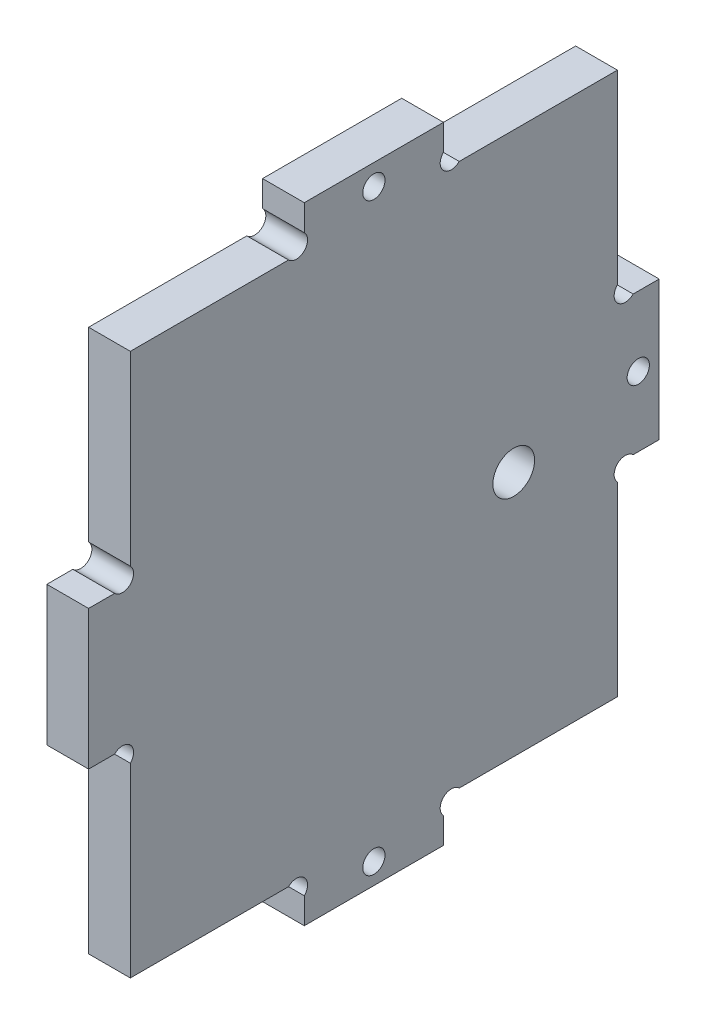
ISO-10303-21;
HEADER;
FILE_DESCRIPTION(('STEP AP214'),'2;1');
FILE_NAME('part.step','',(''),(''),'','','');
FILE_SCHEMA(('AUTOMOTIVE_DESIGN { 1 0 10303 214 1 1 1 1 }'));
ENDSEC;
DATA;
#1=APPLICATION_CONTEXT('core data for automotive mechanical design processes');
#2=APPLICATION_PROTOCOL_DEFINITION('international standard','automotive_design',2000,#1);
#3=PRODUCT_CONTEXT('',#1,'mechanical');
#4=PRODUCT('Part','Part','',(#3));
#5=PRODUCT_RELATED_PRODUCT_CATEGORY('part','',(#4));
#6=PRODUCT_DEFINITION_FORMATION('','',#4);
#7=PRODUCT_DEFINITION_CONTEXT('part definition',#1,'design');
#8=PRODUCT_DEFINITION('design','',#6,#7);
#9=PRODUCT_DEFINITION_SHAPE('','',#8);
#10=(LENGTH_UNIT() NAMED_UNIT(*) SI_UNIT(.MILLI.,.METRE.));
#11=(NAMED_UNIT(*) PLANE_ANGLE_UNIT() SI_UNIT($,.RADIAN.));
#12=(NAMED_UNIT(*) SI_UNIT($,.STERADIAN.) SOLID_ANGLE_UNIT());
#13=UNCERTAINTY_MEASURE_WITH_UNIT(LENGTH_MEASURE(1.E-05),#10,'distance_accuracy_value','');
#14=(GEOMETRIC_REPRESENTATION_CONTEXT(3) GLOBAL_UNCERTAINTY_ASSIGNED_CONTEXT((#13)) GLOBAL_UNIT_ASSIGNED_CONTEXT((#10,
#11,#12)) REPRESENTATION_CONTEXT('',''));
#15=CARTESIAN_POINT('',(0.,0.,0.));
#16=DIRECTION('',(0.,0.,1.));
#17=DIRECTION('',(1.,0.,0.));
#18=AXIS2_PLACEMENT_3D('',#15,#16,#17);
#19=CARTESIAN_POINT('',(6.,4.86862915010148,-29.8686291501015));
#20=DIRECTION('',(1.,0.,0.));
#21=DIRECTION('',(0.,0.,-1.));
#22=AXIS2_PLACEMENT_3D('',#19,#20,#21);
#23=PLANE('',#22);
#24=CARTESIAN_POINT('',(6.,87.,-41.));
#25=DIRECTION('',(1.,0.,0.));
#26=DIRECTION('',(0.,0.,1.));
#27=AXIS2_PLACEMENT_3D('',#24,#25,#26);
#28=CIRCLE('',#27,1.6);
#29=CARTESIAN_POINT('',(6.,87.,-39.4));
#30=VERTEX_POINT('',#29);
#31=EDGE_CURVE('E499',#30,#30,#28,.T.);
#32=ORIENTED_EDGE('',*,*,#31,.F.);
#33=EDGE_LOOP('',(#32));
#34=FACE_BOUND('',#33,.T.);
#35=CARTESIAN_POINT('',(6.,3.,-41.));
#36=DIRECTION('',(1.,0.,0.));
#37=DIRECTION('',(0.,0.,-1.));
#38=AXIS2_PLACEMENT_3D('',#35,#36,#37);
#39=CIRCLE('',#38,1.6);
#40=CARTESIAN_POINT('',(6.,3.,-42.6));
#41=VERTEX_POINT('',#40);
#42=EDGE_CURVE('E253',#41,#41,#39,.T.);
#43=ORIENTED_EDGE('',*,*,#42,.F.);
#44=EDGE_LOOP('',(#43));
#45=FACE_BOUND('',#44,.T.);
#46=CARTESIAN_POINT('',(6.,4.86862915010148,-29.8686291501015));
#47=DIRECTION('',(-1.,0.,0.));
#48=DIRECTION('',(0.,0.,-1.));
#49=AXIS2_PLACEMENT_3D('',#46,#47,#48);
#50=CIRCLE('',#49,1.60000000000008);
#51=CARTESIAN_POINT('',(6.,6.,-28.7372583002029));
#52=VERTEX_POINT('',#51);
#53=CARTESIAN_POINT('',(6.,3.73725830020295,-31.));
#54=VERTEX_POINT('',#53);
#55=EDGE_CURVE('E304',#52,#54,#50,.T.);
#56=ORIENTED_EDGE('',*,*,#55,.T.);
#57=DIRECTION('',(0.,-1.,0.));
#58=VECTOR('',#57,1.);
#59=CARTESIAN_POINT('',(6.,3.73725830020295,-31.));
#60=LINE('',#59,#58);
#61=CARTESIAN_POINT('',(6.,0.,-31.));
#62=VERTEX_POINT('',#61);
#63=EDGE_CURVE('E152',#54,#62,#60,.T.);
#64=ORIENTED_EDGE('',*,*,#63,.T.);
#65=DIRECTION('',(0.,0.,-1.));
#66=VECTOR('',#65,1.);
#67=CARTESIAN_POINT('',(6.,0.,-31.));
#68=LINE('',#67,#66);
#69=CARTESIAN_POINT('',(6.,0.,-51.));
#70=VERTEX_POINT('',#69);
#71=EDGE_CURVE('E379',#62,#70,#68,.T.);
#72=ORIENTED_EDGE('',*,*,#71,.T.);
#73=DIRECTION('',(0.,1.,0.));
#74=VECTOR('',#73,1.);
#75=CARTESIAN_POINT('',(6.,0.,-51.));
#76=LINE('',#75,#74);
#77=CARTESIAN_POINT('',(6.,3.73725830020301,-51.));
#78=VERTEX_POINT('',#77);
#79=EDGE_CURVE('E398',#70,#78,#76,.T.);
#80=ORIENTED_EDGE('',*,*,#79,.T.);
#81=CARTESIAN_POINT('',(6.,4.86862915010151,-52.1313708498985));
#82=DIRECTION('',(-1.,0.,0.));
#83=DIRECTION('',(0.,0.,1.));
#84=AXIS2_PLACEMENT_3D('',#81,#82,#83);
#85=CIRCLE('',#84,1.60000000000005);
#86=CARTESIAN_POINT('',(6.,6.,-53.2627416997971));
#87=VERTEX_POINT('',#86);
#88=EDGE_CURVE('E395',#78,#87,#85,.T.);
#89=ORIENTED_EDGE('',*,*,#88,.T.);
#90=DIRECTION('',(0.,0.,-1.));
#91=VECTOR('',#90,1.);
#92=CARTESIAN_POINT('',(6.,6.,-53.2627416997971));
#93=LINE('',#92,#91);
#94=CARTESIAN_POINT('',(6.,6.00000000000001,-76.));
#95=VERTEX_POINT('',#94);
#96=EDGE_CURVE('E397',#87,#95,#93,.T.);
#97=ORIENTED_EDGE('',*,*,#96,.T.);
#98=DIRECTION('',(0.,1.,0.));
#99=VECTOR('',#98,1.);
#100=CARTESIAN_POINT('',(6.,32.7372583002031,-76.));
#101=LINE('',#100,#99);
#102=CARTESIAN_POINT('',(6.,32.7372583002031,-76.));
#103=VERTEX_POINT('',#102);
#104=EDGE_CURVE('E400',#95,#103,#101,.T.);
#105=ORIENTED_EDGE('',*,*,#104,.T.);
#106=CARTESIAN_POINT('',(6.,33.8686291501015,-77.1313708498985));
#107=DIRECTION('',(-1.,0.,0.));
#108=DIRECTION('',(0.,0.,1.));
#109=AXIS2_PLACEMENT_3D('',#106,#107,#108);
#110=CIRCLE('',#109,1.59999999999997);
#111=CARTESIAN_POINT('',(6.,35.,-78.2627416997969));
#112=VERTEX_POINT('',#111);
#113=EDGE_CURVE('E406',#103,#112,#110,.T.);
#114=ORIENTED_EDGE('',*,*,#113,.T.);
#115=DIRECTION('',(0.,0.,-1.));
#116=VECTOR('',#115,1.);
#117=CARTESIAN_POINT('',(6.,35.,-78.2627416997969));
#118=LINE('',#117,#116);
#119=CARTESIAN_POINT('',(6.,35.,-82.));
#120=VERTEX_POINT('',#119);
#121=EDGE_CURVE('E408',#112,#120,#118,.T.);
#122=ORIENTED_EDGE('',*,*,#121,.T.);
#123=DIRECTION('',(0.,1.,0.));
#124=VECTOR('',#123,1.);
#125=CARTESIAN_POINT('',(6.,35.,-82.));
#126=LINE('',#125,#124);
#127=CARTESIAN_POINT('',(6.,55.,-82.));
#128=VERTEX_POINT('',#127);
#129=EDGE_CURVE('E410',#120,#128,#126,.T.);
#130=ORIENTED_EDGE('',*,*,#129,.T.);
#131=DIRECTION('',(0.,0.,1.));
#132=VECTOR('',#131,1.);
#133=CARTESIAN_POINT('',(6.,55.,-82.));
#134=LINE('',#133,#132);
#135=CARTESIAN_POINT('',(6.,55.,-78.2627416997969));
#136=VERTEX_POINT('',#135);
#137=EDGE_CURVE('E412',#128,#136,#134,.T.);
#138=ORIENTED_EDGE('',*,*,#137,.T.);
#139=CARTESIAN_POINT('',(6.,56.1313708498985,-77.1313708498985));
#140=DIRECTION('',(-1.,0.,0.));
#141=DIRECTION('',(0.,0.,-1.));
#142=AXIS2_PLACEMENT_3D('',#139,#140,#141);
#143=CIRCLE('',#142,1.59999999999997);
#144=CARTESIAN_POINT('',(6.,57.2627416997969,-76.));
#145=VERTEX_POINT('',#144);
#146=EDGE_CURVE('E414',#136,#145,#143,.T.);
#147=ORIENTED_EDGE('',*,*,#146,.T.);
#148=DIRECTION('',(0.,1.,0.));
#149=VECTOR('',#148,1.);
#150=CARTESIAN_POINT('',(6.,84.,-76.));
#151=LINE('',#150,#149);
#152=CARTESIAN_POINT('',(6.,84.,-76.));
#153=VERTEX_POINT('',#152);
#154=EDGE_CURVE('E416',#145,#153,#151,.T.);
#155=ORIENTED_EDGE('',*,*,#154,.T.);
#156=DIRECTION('',(0.,0.,1.));
#157=VECTOR('',#156,1.);
#158=CARTESIAN_POINT('',(6.,84.,-53.2627416997971));
#159=LINE('',#158,#157);
#160=CARTESIAN_POINT('',(6.,84.,-53.262741699797));
#161=VERTEX_POINT('',#160);
#162=EDGE_CURVE('E418',#153,#161,#159,.T.);
#163=ORIENTED_EDGE('',*,*,#162,.T.);
#164=CARTESIAN_POINT('',(6.,85.1313708498985,-52.1313708498985));
#165=DIRECTION('',(-1.,0.,0.));
#166=DIRECTION('',(0.,0.,-1.));
#167=AXIS2_PLACEMENT_3D('',#164,#165,#166);
#168=CIRCLE('',#167,1.60000000000005);
#169=CARTESIAN_POINT('',(6.,86.262741699797,-51.));
#170=VERTEX_POINT('',#169);
#171=EDGE_CURVE('E420',#161,#170,#168,.T.);
#172=ORIENTED_EDGE('',*,*,#171,.T.);
#173=DIRECTION('',(0.,1.,0.));
#174=VECTOR('',#173,1.);
#175=CARTESIAN_POINT('',(6.,90.,-51.));
#176=LINE('',#175,#174);
#177=CARTESIAN_POINT('',(6.,90.,-51.));
#178=VERTEX_POINT('',#177);
#179=EDGE_CURVE('E422',#170,#178,#176,.T.);
#180=ORIENTED_EDGE('',*,*,#179,.T.);
#181=DIRECTION('',(0.,0.,1.));
#182=VECTOR('',#181,1.);
#183=CARTESIAN_POINT('',(6.,90.,-31.));
#184=LINE('',#183,#182);
#185=CARTESIAN_POINT('',(6.,90.,-31.));
#186=VERTEX_POINT('',#185);
#187=EDGE_CURVE('E424',#178,#186,#184,.T.);
#188=ORIENTED_EDGE('',*,*,#187,.T.);
#189=DIRECTION('',(0.,-1.,0.));
#190=VECTOR('',#189,1.);
#191=CARTESIAN_POINT('',(6.,86.262741699797,-31.));
#192=LINE('',#191,#190);
#193=CARTESIAN_POINT('',(6.,86.262741699797,-31.));
#194=VERTEX_POINT('',#193);
#195=EDGE_CURVE('E426',#186,#194,#192,.T.);
#196=ORIENTED_EDGE('',*,*,#195,.T.);
#197=CARTESIAN_POINT('',(6.,85.1313708498985,-29.8686291501015));
#198=DIRECTION('',(-1.,0.,0.));
#199=DIRECTION('',(0.,0.,1.));
#200=AXIS2_PLACEMENT_3D('',#197,#198,#199);
#201=CIRCLE('',#200,1.60000000000005);
#202=CARTESIAN_POINT('',(6.,84.,-28.737258300203));
#203=VERTEX_POINT('',#202);
#204=EDGE_CURVE('E428',#194,#203,#201,.T.);
#205=ORIENTED_EDGE('',*,*,#204,.T.);
#206=DIRECTION('',(0.,0.,1.));
#207=VECTOR('',#206,1.);
#208=CARTESIAN_POINT('',(6.,84.,-5.99999999999998));
#209=LINE('',#208,#207);
#210=CARTESIAN_POINT('',(6.,84.,-5.99999999999998));
#211=VERTEX_POINT('',#210);
#212=EDGE_CURVE('E430',#203,#211,#209,.T.);
#213=ORIENTED_EDGE('',*,*,#212,.T.);
#214=DIRECTION('',(0.,-1.,0.));
#215=VECTOR('',#214,1.);
#216=CARTESIAN_POINT('',(6.,84.,-5.99999999999998));
#217=LINE('',#216,#215);
#218=CARTESIAN_POINT('',(6.,57.2627416997969,-5.99999999999998));
#219=VERTEX_POINT('',#218);
#220=EDGE_CURVE('E432',#211,#219,#217,.T.);
#221=ORIENTED_EDGE('',*,*,#220,.T.);
#222=CARTESIAN_POINT('',(6.,56.1313708498985,-4.86862915010152));
#223=DIRECTION('',(-1.,0.,0.));
#224=DIRECTION('',(0.,0.,1.));
#225=AXIS2_PLACEMENT_3D('',#222,#223,#224);
#226=CIRCLE('',#225,1.59999999999999);
#227=CARTESIAN_POINT('',(6.,55.,-3.73725830020304));
#228=VERTEX_POINT('',#227);
#229=EDGE_CURVE('E434',#219,#228,#226,.T.);
#230=ORIENTED_EDGE('',*,*,#229,.T.);
#231=DIRECTION('',(0.,0.,1.));
#232=VECTOR('',#231,1.);
#233=CARTESIAN_POINT('',(6.,55.,0.));
#234=LINE('',#233,#232);
#235=CARTESIAN_POINT('',(6.,55.,0.));
#236=VERTEX_POINT('',#235);
#237=EDGE_CURVE('E436',#228,#236,#234,.T.);
#238=ORIENTED_EDGE('',*,*,#237,.T.);
#239=DIRECTION('',(0.,-1.,0.));
#240=VECTOR('',#239,1.);
#241=CARTESIAN_POINT('',(6.,35.,0.));
#242=LINE('',#241,#240);
#243=CARTESIAN_POINT('',(6.,35.,0.));
#244=VERTEX_POINT('',#243);
#245=EDGE_CURVE('E438',#236,#244,#242,.T.);
#246=ORIENTED_EDGE('',*,*,#245,.T.);
#247=DIRECTION('',(0.,0.,-1.));
#248=VECTOR('',#247,1.);
#249=CARTESIAN_POINT('',(6.,35.,-3.73725830020312));
#250=LINE('',#249,#248);
#251=CARTESIAN_POINT('',(6.,35.,-3.73725830020312));
#252=VERTEX_POINT('',#251);
#253=EDGE_CURVE('E231',#244,#252,#250,.T.);
#254=ORIENTED_EDGE('',*,*,#253,.T.);
#255=CARTESIAN_POINT('',(6.,33.8686291501016,-4.86862915010156));
#256=DIRECTION('',(-1.,0.,0.));
#257=DIRECTION('',(0.,0.,-1.));
#258=AXIS2_PLACEMENT_3D('',#255,#256,#257);
#259=CIRCLE('',#258,1.59999999999995);
#260=CARTESIAN_POINT('',(6.,32.7372583002031,-6.00000000000001));
#261=VERTEX_POINT('',#260);
#262=EDGE_CURVE('E225',#252,#261,#259,.T.);
#263=ORIENTED_EDGE('',*,*,#262,.T.);
#264=DIRECTION('',(0.,-1.,0.));
#265=VECTOR('',#264,1.);
#266=CARTESIAN_POINT('',(6.,32.7372583002031,-6.00000000000001));
#267=LINE('',#266,#265);
#268=CARTESIAN_POINT('',(6.,6.,-6.00000000000001));
#269=VERTEX_POINT('',#268);
#270=EDGE_CURVE('E229',#261,#269,#267,.T.);
#271=ORIENTED_EDGE('',*,*,#270,.T.);
#272=DIRECTION('',(0.,0.,-1.));
#273=VECTOR('',#272,1.);
#274=CARTESIAN_POINT('',(6.,6.,-6.00000000000001));
#275=LINE('',#274,#273);
#276=EDGE_CURVE('E49',#269,#52,#275,.T.);
#277=ORIENTED_EDGE('',*,*,#276,.T.);
#278=EDGE_LOOP('',(#56,#64,#72,#80,#89,#97,#105,#114,#122,#130,#138,#147,#155,#163,#172,#180,
#188,#196,#205,#213,#221,#230,#238,#246,#254,#263,#271,#277));
#279=FACE_BOUND('',#278,.T.);
#280=CARTESIAN_POINT('',(6.,45.,-79.));
#281=DIRECTION('',(1.,0.,0.));
#282=DIRECTION('',(0.,0.,1.));
#283=AXIS2_PLACEMENT_3D('',#280,#281,#282);
#284=CIRCLE('',#283,1.60000000000001);
#285=CARTESIAN_POINT('',(6.,45.,-77.4));
#286=VERTEX_POINT('',#285);
#287=EDGE_CURVE('E505',#286,#286,#284,.T.);
#288=ORIENTED_EDGE('',*,*,#287,.F.);
#289=EDGE_LOOP('',(#288));
#290=FACE_BOUND('',#289,.T.);
#291=CARTESIAN_POINT('',(6.,41.4,-61.1));
#292=DIRECTION('',(1.,0.,0.));
#293=DIRECTION('',(0.,0.,-1.));
#294=AXIS2_PLACEMENT_3D('',#291,#292,#293);
#295=CIRCLE('',#294,3.00000000000001);
#296=CARTESIAN_POINT('',(6.,41.4,-64.1));
#297=VERTEX_POINT('',#296);
#298=EDGE_CURVE('E490',#297,#297,#295,.T.);
#299=ORIENTED_EDGE('',*,*,#298,.F.);
#300=EDGE_LOOP('',(#299));
#301=FACE_BOUND('',#300,.T.);
#302=ADVANCED_FACE('F32',(#34,#45,#279,#290,#301),#23,.T.);
#303=CARTESIAN_POINT('',(0.,4.86862915010148,-29.8686291501015));
#304=DIRECTION('',(1.,0.,0.));
#305=DIRECTION('',(0.,0.,-1.));
#306=AXIS2_PLACEMENT_3D('',#303,#304,#305);
#307=PLANE('',#306);
#308=CARTESIAN_POINT('',(0.,87.,-41.));
#309=DIRECTION('',(1.,0.,0.));
#310=DIRECTION('',(0.,0.,1.));
#311=AXIS2_PLACEMENT_3D('',#308,#309,#310);
#312=CIRCLE('',#311,1.6);
#313=CARTESIAN_POINT('',(0.,87.,-39.4));
#314=VERTEX_POINT('',#313);
#315=EDGE_CURVE('E496',#314,#314,#312,.T.);
#316=ORIENTED_EDGE('',*,*,#315,.T.);
#317=EDGE_LOOP('',(#316));
#318=FACE_BOUND('',#317,.T.);
#319=CARTESIAN_POINT('',(0.,3.,-41.));
#320=DIRECTION('',(1.,0.,0.));
#321=DIRECTION('',(0.,0.,-1.));
#322=AXIS2_PLACEMENT_3D('',#319,#320,#321);
#323=CIRCLE('',#322,1.6);
#324=CARTESIAN_POINT('',(0.,3.,-42.6));
#325=VERTEX_POINT('',#324);
#326=EDGE_CURVE('E508',#325,#325,#323,.T.);
#327=ORIENTED_EDGE('',*,*,#326,.T.);
#328=EDGE_LOOP('',(#327));
#329=FACE_BOUND('',#328,.T.);
#330=CARTESIAN_POINT('',(0.,4.86862915010148,-29.8686291501015));
#331=DIRECTION('',(-1.,0.,0.));
#332=DIRECTION('',(0.,0.,-1.));
#333=AXIS2_PLACEMENT_3D('',#330,#331,#332);
#334=CIRCLE('',#333,1.60000000000008);
#335=CARTESIAN_POINT('',(0.,6.,-28.7372583002029));
#336=VERTEX_POINT('',#335);
#337=CARTESIAN_POINT('',(0.,3.73725830020295,-31.));
#338=VERTEX_POINT('',#337);
#339=EDGE_CURVE('E249',#336,#338,#334,.T.);
#340=ORIENTED_EDGE('',*,*,#339,.F.);
#341=DIRECTION('',(0.,0.,-1.));
#342=VECTOR('',#341,1.);
#343=CARTESIAN_POINT('',(0.,6.,-6.00000000000001));
#344=LINE('',#343,#342);
#345=CARTESIAN_POINT('',(0.,6.,-6.00000000000001));
#346=VERTEX_POINT('',#345);
#347=EDGE_CURVE('E144',#346,#336,#344,.T.);
#348=ORIENTED_EDGE('',*,*,#347,.F.);
#349=DIRECTION('',(0.,-1.,0.));
#350=VECTOR('',#349,1.);
#351=CARTESIAN_POINT('',(0.,32.7372583002031,-6.00000000000001));
#352=LINE('',#351,#350);
#353=CARTESIAN_POINT('',(0.,32.7372583002031,-6.00000000000001));
#354=VERTEX_POINT('',#353);
#355=EDGE_CURVE('E138',#354,#346,#352,.T.);
#356=ORIENTED_EDGE('',*,*,#355,.F.);
#357=CARTESIAN_POINT('',(0.,33.8686291501016,-4.86862915010156));
#358=DIRECTION('',(-1.,0.,0.));
#359=DIRECTION('',(0.,0.,-1.));
#360=AXIS2_PLACEMENT_3D('',#357,#358,#359);
#361=CIRCLE('',#360,1.59999999999995);
#362=CARTESIAN_POINT('',(0.,35.,-3.73725830020312));
#363=VERTEX_POINT('',#362);
#364=EDGE_CURVE('E239',#363,#354,#361,.T.);
#365=ORIENTED_EDGE('',*,*,#364,.F.);
#366=DIRECTION('',(0.,0.,-1.));
#367=VECTOR('',#366,1.);
#368=CARTESIAN_POINT('',(0.,35.,-3.73725830020312));
#369=LINE('',#368,#367);
#370=CARTESIAN_POINT('',(0.,35.,0.));
#371=VERTEX_POINT('',#370);
#372=EDGE_CURVE('E299',#371,#363,#369,.T.);
#373=ORIENTED_EDGE('',*,*,#372,.F.);
#374=DIRECTION('',(0.,-1.,0.));
#375=VECTOR('',#374,1.);
#376=CARTESIAN_POINT('',(0.,35.,0.));
#377=LINE('',#376,#375);
#378=CARTESIAN_POINT('',(0.,55.,0.));
#379=VERTEX_POINT('',#378);
#380=EDGE_CURVE('E297',#379,#371,#377,.T.);
#381=ORIENTED_EDGE('',*,*,#380,.F.);
#382=DIRECTION('',(0.,0.,1.));
#383=VECTOR('',#382,1.);
#384=CARTESIAN_POINT('',(0.,55.,0.));
#385=LINE('',#384,#383);
#386=CARTESIAN_POINT('',(0.,55.,-3.73725830020304));
#387=VERTEX_POINT('',#386);
#388=EDGE_CURVE('E295',#387,#379,#385,.T.);
#389=ORIENTED_EDGE('',*,*,#388,.F.);
#390=CARTESIAN_POINT('',(0.,56.1313708498985,-4.86862915010152));
#391=DIRECTION('',(-1.,0.,0.));
#392=DIRECTION('',(0.,0.,1.));
#393=AXIS2_PLACEMENT_3D('',#390,#391,#392);
#394=CIRCLE('',#393,1.59999999999999);
#395=CARTESIAN_POINT('',(0.,57.2627416997969,-5.99999999999998));
#396=VERTEX_POINT('',#395);
#397=EDGE_CURVE('E293',#396,#387,#394,.T.);
#398=ORIENTED_EDGE('',*,*,#397,.F.);
#399=DIRECTION('',(0.,-1.,0.));
#400=VECTOR('',#399,1.);
#401=CARTESIAN_POINT('',(0.,84.,-5.99999999999998));
#402=LINE('',#401,#400);
#403=CARTESIAN_POINT('',(0.,84.,-5.99999999999998));
#404=VERTEX_POINT('',#403);
#405=EDGE_CURVE('E291',#404,#396,#402,.T.);
#406=ORIENTED_EDGE('',*,*,#405,.F.);
#407=DIRECTION('',(0.,0.,1.));
#408=VECTOR('',#407,1.);
#409=CARTESIAN_POINT('',(0.,84.,-5.99999999999998));
#410=LINE('',#409,#408);
#411=CARTESIAN_POINT('',(0.,84.,-28.737258300203));
#412=VERTEX_POINT('',#411);
#413=EDGE_CURVE('E289',#412,#404,#410,.T.);
#414=ORIENTED_EDGE('',*,*,#413,.F.);
#415=CARTESIAN_POINT('',(0.,85.1313708498985,-29.8686291501015));
#416=DIRECTION('',(-1.,0.,0.));
#417=DIRECTION('',(0.,0.,1.));
#418=AXIS2_PLACEMENT_3D('',#415,#416,#417);
#419=CIRCLE('',#418,1.60000000000005);
#420=CARTESIAN_POINT('',(0.,86.262741699797,-31.));
#421=VERTEX_POINT('',#420);
#422=EDGE_CURVE('E287',#421,#412,#419,.T.);
#423=ORIENTED_EDGE('',*,*,#422,.F.);
#424=DIRECTION('',(0.,-1.,0.));
#425=VECTOR('',#424,1.);
#426=CARTESIAN_POINT('',(0.,86.262741699797,-31.));
#427=LINE('',#426,#425);
#428=CARTESIAN_POINT('',(0.,90.,-31.));
#429=VERTEX_POINT('',#428);
#430=EDGE_CURVE('E285',#429,#421,#427,.T.);
#431=ORIENTED_EDGE('',*,*,#430,.F.);
#432=DIRECTION('',(0.,0.,1.));
#433=VECTOR('',#432,1.);
#434=CARTESIAN_POINT('',(0.,90.,-31.));
#435=LINE('',#434,#433);
#436=CARTESIAN_POINT('',(0.,90.,-51.));
#437=VERTEX_POINT('',#436);
#438=EDGE_CURVE('E283',#437,#429,#435,.T.);
#439=ORIENTED_EDGE('',*,*,#438,.F.);
#440=DIRECTION('',(0.,1.,0.));
#441=VECTOR('',#440,1.);
#442=CARTESIAN_POINT('',(0.,90.,-51.));
#443=LINE('',#442,#441);
#444=CARTESIAN_POINT('',(0.,86.262741699797,-51.));
#445=VERTEX_POINT('',#444);
#446=EDGE_CURVE('E281',#445,#437,#443,.T.);
#447=ORIENTED_EDGE('',*,*,#446,.F.);
#448=CARTESIAN_POINT('',(0.,85.1313708498985,-52.1313708498985));
#449=DIRECTION('',(-1.,0.,0.));
#450=DIRECTION('',(0.,0.,-1.));
#451=AXIS2_PLACEMENT_3D('',#448,#449,#450);
#452=CIRCLE('',#451,1.60000000000005);
#453=CARTESIAN_POINT('',(0.,84.,-53.262741699797));
#454=VERTEX_POINT('',#453);
#455=EDGE_CURVE('E279',#454,#445,#452,.T.);
#456=ORIENTED_EDGE('',*,*,#455,.F.);
#457=DIRECTION('',(0.,0.,1.));
#458=VECTOR('',#457,1.);
#459=CARTESIAN_POINT('',(0.,84.,-53.2627416997971));
#460=LINE('',#459,#458);
#461=CARTESIAN_POINT('',(0.,84.,-76.));
#462=VERTEX_POINT('',#461);
#463=EDGE_CURVE('E277',#462,#454,#460,.T.);
#464=ORIENTED_EDGE('',*,*,#463,.F.);
#465=DIRECTION('',(0.,1.,0.));
#466=VECTOR('',#465,1.);
#467=CARTESIAN_POINT('',(0.,84.,-76.));
#468=LINE('',#467,#466);
#469=CARTESIAN_POINT('',(0.,57.2627416997969,-76.));
#470=VERTEX_POINT('',#469);
#471=EDGE_CURVE('E275',#470,#462,#468,.T.);
#472=ORIENTED_EDGE('',*,*,#471,.F.);
#473=CARTESIAN_POINT('',(0.,56.1313708498985,-77.1313708498985));
#474=DIRECTION('',(-1.,0.,0.));
#475=DIRECTION('',(0.,0.,-1.));
#476=AXIS2_PLACEMENT_3D('',#473,#474,#475);
#477=CIRCLE('',#476,1.59999999999997);
#478=CARTESIAN_POINT('',(0.,55.,-78.2627416997969));
#479=VERTEX_POINT('',#478);
#480=EDGE_CURVE('E273',#479,#470,#477,.T.);
#481=ORIENTED_EDGE('',*,*,#480,.F.);
#482=DIRECTION('',(0.,0.,1.));
#483=VECTOR('',#482,1.);
#484=CARTESIAN_POINT('',(0.,55.,-82.));
#485=LINE('',#484,#483);
#486=CARTESIAN_POINT('',(0.,55.,-82.));
#487=VERTEX_POINT('',#486);
#488=EDGE_CURVE('E271',#487,#479,#485,.T.);
#489=ORIENTED_EDGE('',*,*,#488,.F.);
#490=DIRECTION('',(0.,1.,0.));
#491=VECTOR('',#490,1.);
#492=CARTESIAN_POINT('',(0.,35.,-82.));
#493=LINE('',#492,#491);
#494=CARTESIAN_POINT('',(0.,35.,-82.));
#495=VERTEX_POINT('',#494);
#496=EDGE_CURVE('E269',#495,#487,#493,.T.);
#497=ORIENTED_EDGE('',*,*,#496,.F.);
#498=DIRECTION('',(0.,0.,-1.));
#499=VECTOR('',#498,1.);
#500=CARTESIAN_POINT('',(0.,35.,-78.2627416997969));
#501=LINE('',#500,#499);
#502=CARTESIAN_POINT('',(0.,35.,-78.2627416997969));
#503=VERTEX_POINT('',#502);
#504=EDGE_CURVE('E267',#503,#495,#501,.T.);
#505=ORIENTED_EDGE('',*,*,#504,.F.);
#506=CARTESIAN_POINT('',(0.,33.8686291501015,-77.1313708498985));
#507=DIRECTION('',(-1.,0.,0.));
#508=DIRECTION('',(0.,0.,1.));
#509=AXIS2_PLACEMENT_3D('',#506,#507,#508);
#510=CIRCLE('',#509,1.59999999999997);
#511=CARTESIAN_POINT('',(0.,32.7372583002031,-76.));
#512=VERTEX_POINT('',#511);
#513=EDGE_CURVE('E265',#512,#503,#510,.T.);
#514=ORIENTED_EDGE('',*,*,#513,.F.);
#515=DIRECTION('',(0.,1.,0.));
#516=VECTOR('',#515,1.);
#517=CARTESIAN_POINT('',(0.,32.7372583002031,-76.));
#518=LINE('',#517,#516);
#519=CARTESIAN_POINT('',(0.,6.00000000000001,-76.));
#520=VERTEX_POINT('',#519);
#521=EDGE_CURVE('E263',#520,#512,#518,.T.);
#522=ORIENTED_EDGE('',*,*,#521,.F.);
#523=DIRECTION('',(0.,0.,-1.));
#524=VECTOR('',#523,1.);
#525=CARTESIAN_POINT('',(0.,6.,-53.2627416997971));
#526=LINE('',#525,#524);
#527=CARTESIAN_POINT('',(0.,6.,-53.2627416997971));
#528=VERTEX_POINT('',#527);
#529=EDGE_CURVE('E261',#528,#520,#526,.T.);
#530=ORIENTED_EDGE('',*,*,#529,.F.);
#531=CARTESIAN_POINT('',(0.,4.86862915010151,-52.1313708498985));
#532=DIRECTION('',(-1.,0.,0.));
#533=DIRECTION('',(0.,0.,1.));
#534=AXIS2_PLACEMENT_3D('',#531,#532,#533);
#535=CIRCLE('',#534,1.60000000000005);
#536=CARTESIAN_POINT('',(0.,3.73725830020301,-51.));
#537=VERTEX_POINT('',#536);
#538=EDGE_CURVE('E259',#537,#528,#535,.T.);
#539=ORIENTED_EDGE('',*,*,#538,.F.);
#540=DIRECTION('',(0.,1.,0.));
#541=VECTOR('',#540,1.);
#542=CARTESIAN_POINT('',(0.,0.,-51.));
#543=LINE('',#542,#541);
#544=CARTESIAN_POINT('',(0.,0.,-51.));
#545=VERTEX_POINT('',#544);
#546=EDGE_CURVE('E257',#545,#537,#543,.T.);
#547=ORIENTED_EDGE('',*,*,#546,.F.);
#548=DIRECTION('',(0.,0.,-1.));
#549=VECTOR('',#548,1.);
#550=CARTESIAN_POINT('',(0.,0.,-31.));
#551=LINE('',#550,#549);
#552=CARTESIAN_POINT('',(0.,0.,-31.));
#553=VERTEX_POINT('',#552);
#554=EDGE_CURVE('E255',#553,#545,#551,.T.);
#555=ORIENTED_EDGE('',*,*,#554,.F.);
#556=DIRECTION('',(0.,-1.,0.));
#557=VECTOR('',#556,1.);
#558=CARTESIAN_POINT('',(0.,3.73725830020295,-31.));
#559=LINE('',#558,#557);
#560=EDGE_CURVE('E252',#338,#553,#559,.T.);
#561=ORIENTED_EDGE('',*,*,#560,.F.);
#562=EDGE_LOOP('',(#340,#348,#356,#365,#373,#381,#389,#398,#406,#414,#423,#431,#439,#447,#456,
#464,#472,#481,#489,#497,#505,#514,#522,#530,#539,#547,#555,#561));
#563=FACE_BOUND('',#562,.T.);
#564=CARTESIAN_POINT('',(0.,45.,-79.));
#565=DIRECTION('',(1.,0.,0.));
#566=DIRECTION('',(0.,0.,1.));
#567=AXIS2_PLACEMENT_3D('',#564,#565,#566);
#568=CIRCLE('',#567,1.60000000000001);
#569=CARTESIAN_POINT('',(0.,45.,-77.4));
#570=VERTEX_POINT('',#569);
#571=EDGE_CURVE('E502',#570,#570,#568,.T.);
#572=ORIENTED_EDGE('',*,*,#571,.T.);
#573=EDGE_LOOP('',(#572));
#574=FACE_BOUND('',#573,.T.);
#575=CARTESIAN_POINT('',(0.,41.4,-61.1));
#576=DIRECTION('',(1.,0.,0.));
#577=DIRECTION('',(0.,0.,-1.));
#578=AXIS2_PLACEMENT_3D('',#575,#576,#577);
#579=CIRCLE('',#578,3.00000000000001);
#580=CARTESIAN_POINT('',(0.,41.4,-64.1));
#581=VERTEX_POINT('',#580);
#582=EDGE_CURVE('E493',#581,#581,#579,.T.);
#583=ORIENTED_EDGE('',*,*,#582,.T.);
#584=EDGE_LOOP('',(#583));
#585=FACE_BOUND('',#584,.T.);
#586=ADVANCED_FACE('F383',(#318,#329,#563,#574,#585),#307,.F.);
#587=CARTESIAN_POINT('',(6.,4.86862915010148,-29.8686291501015));
#588=DIRECTION('',(-1.,0.,0.));
#589=DIRECTION('',(0.,0.,1.));
#590=AXIS2_PLACEMENT_3D('',#587,#588,#589);
#591=CYLINDRICAL_SURFACE('',#590,1.60000000000008);
#592=ORIENTED_EDGE('',*,*,#339,.T.);
#593=DIRECTION('',(-1.,0.,0.));
#594=VECTOR('',#593,1.);
#595=CARTESIAN_POINT('',(6.,3.73725830020295,-31.));
#596=LINE('',#595,#594);
#597=EDGE_CURVE('E11',#54,#338,#596,.T.);
#598=ORIENTED_EDGE('',*,*,#597,.F.);
#599=ORIENTED_EDGE('',*,*,#55,.F.);
#600=DIRECTION('',(-1.,0.,0.));
#601=VECTOR('',#600,1.);
#602=CARTESIAN_POINT('',(6.,6.,-28.7372583002029));
#603=LINE('',#602,#601);
#604=EDGE_CURVE('E245',#52,#336,#603,.T.);
#605=ORIENTED_EDGE('',*,*,#604,.T.);
#606=EDGE_LOOP('',(#592,#598,#599,#605));
#607=FACE_BOUND('',#606,.T.);
#608=ADVANCED_FACE('F34',(#607),#591,.F.);
#609=CARTESIAN_POINT('',(6.,3.73725830020295,-31.));
#610=DIRECTION('',(0.,0.,-1.));
#611=DIRECTION('',(-1.,0.,0.));
#612=AXIS2_PLACEMENT_3D('',#609,#610,#611);
#613=PLANE('',#612);
#614=ORIENTED_EDGE('',*,*,#560,.T.);
#615=DIRECTION('',(-1.,0.,0.));
#616=VECTOR('',#615,1.);
#617=CARTESIAN_POINT('',(6.,0.,-31.));
#618=LINE('',#617,#616);
#619=EDGE_CURVE('E41',#62,#553,#618,.T.);
#620=ORIENTED_EDGE('',*,*,#619,.F.);
#621=ORIENTED_EDGE('',*,*,#63,.F.);
#622=ORIENTED_EDGE('',*,*,#597,.T.);
#623=EDGE_LOOP('',(#614,#620,#621,#622));
#624=FACE_BOUND('',#623,.T.);
#625=ADVANCED_FACE('F777',(#624),#613,.F.);
#626=CARTESIAN_POINT('',(6.,0.,-31.));
#627=DIRECTION('',(0.,1.,0.));
#628=DIRECTION('',(0.,0.,1.));
#629=AXIS2_PLACEMENT_3D('',#626,#627,#628);
#630=PLANE('',#629);
#631=ORIENTED_EDGE('',*,*,#554,.T.);
#632=DIRECTION('',(-1.,0.,0.));
#633=VECTOR('',#632,1.);
#634=CARTESIAN_POINT('',(6.,0.,-51.));
#635=LINE('',#634,#633);
#636=EDGE_CURVE('E371',#70,#545,#635,.T.);
#637=ORIENTED_EDGE('',*,*,#636,.F.);
#638=ORIENTED_EDGE('',*,*,#71,.F.);
#639=ORIENTED_EDGE('',*,*,#619,.T.);
#640=EDGE_LOOP('',(#631,#637,#638,#639));
#641=FACE_BOUND('',#640,.T.);
#642=ADVANCED_FACE('F377',(#641),#630,.F.);
#643=CARTESIAN_POINT('',(6.,0.,-51.));
#644=DIRECTION('',(0.,0.,1.));
#645=DIRECTION('',(1.,0.,0.));
#646=AXIS2_PLACEMENT_3D('',#643,#644,#645);
#647=PLANE('',#646);
#648=ORIENTED_EDGE('',*,*,#546,.T.);
#649=DIRECTION('',(-1.,0.,0.));
#650=VECTOR('',#649,1.);
#651=CARTESIAN_POINT('',(6.,3.73725830020301,-51.));
#652=LINE('',#651,#650);
#653=EDGE_CURVE('E368',#78,#537,#652,.T.);
#654=ORIENTED_EDGE('',*,*,#653,.F.);
#655=ORIENTED_EDGE('',*,*,#79,.F.);
#656=ORIENTED_EDGE('',*,*,#636,.T.);
#657=EDGE_LOOP('',(#648,#654,#655,#656));
#658=FACE_BOUND('',#657,.T.);
#659=ADVANCED_FACE('F389',(#658),#647,.F.);
#660=CARTESIAN_POINT('',(6.,4.86862915010151,-52.1313708498985));
#661=DIRECTION('',(-1.,0.,0.));
#662=DIRECTION('',(0.,0.,1.));
#663=AXIS2_PLACEMENT_3D('',#660,#661,#662);
#664=CYLINDRICAL_SURFACE('',#663,1.60000000000005);
#665=ORIENTED_EDGE('',*,*,#538,.T.);
#666=DIRECTION('',(-1.,0.,0.));
#667=VECTOR('',#666,1.);
#668=CARTESIAN_POINT('',(6.,6.,-53.2627416997971));
#669=LINE('',#668,#667);
#670=EDGE_CURVE('E365',#87,#528,#669,.T.);
#671=ORIENTED_EDGE('',*,*,#670,.F.);
#672=ORIENTED_EDGE('',*,*,#88,.F.);
#673=ORIENTED_EDGE('',*,*,#653,.T.);
#674=EDGE_LOOP('',(#665,#671,#672,#673));
#675=FACE_BOUND('',#674,.T.);
#676=ADVANCED_FACE('F393',(#675),#664,.F.);
#677=CARTESIAN_POINT('',(6.,6.,-53.2627416997971));
#678=DIRECTION('',(0.,1.,0.));
#679=DIRECTION('',(0.,0.,1.));
#680=AXIS2_PLACEMENT_3D('',#677,#678,#679);
#681=PLANE('',#680);
#682=ORIENTED_EDGE('',*,*,#529,.T.);
#683=DIRECTION('',(-1.,0.,0.));
#684=VECTOR('',#683,1.);
#685=CARTESIAN_POINT('',(6.,6.00000000000001,-76.));
#686=LINE('',#685,#684);
#687=EDGE_CURVE('E362',#95,#520,#686,.T.);
#688=ORIENTED_EDGE('',*,*,#687,.F.);
#689=ORIENTED_EDGE('',*,*,#96,.F.);
#690=ORIENTED_EDGE('',*,*,#670,.T.);
#691=EDGE_LOOP('',(#682,#688,#689,#690));
#692=FACE_BOUND('',#691,.T.);
#693=ADVANCED_FACE('F742',(#692),#681,.F.);
#694=CARTESIAN_POINT('',(6.,32.7372583002031,-76.));
#695=DIRECTION('',(0.,0.,1.));
#696=DIRECTION('',(1.,0.,0.));
#697=AXIS2_PLACEMENT_3D('',#694,#695,#696);
#698=PLANE('',#697);
#699=ORIENTED_EDGE('',*,*,#521,.T.);
#700=DIRECTION('',(-1.,0.,0.));
#701=VECTOR('',#700,1.);
#702=CARTESIAN_POINT('',(6.,32.7372583002031,-76.));
#703=LINE('',#702,#701);
#704=EDGE_CURVE('E359',#103,#512,#703,.T.);
#705=ORIENTED_EDGE('',*,*,#704,.F.);
#706=ORIENTED_EDGE('',*,*,#104,.F.);
#707=ORIENTED_EDGE('',*,*,#687,.T.);
#708=EDGE_LOOP('',(#699,#705,#706,#707));
#709=FACE_BOUND('',#708,.T.);
#710=ADVANCED_FACE('F732',(#709),#698,.F.);
#711=CARTESIAN_POINT('',(6.,33.8686291501015,-77.1313708498985));
#712=DIRECTION('',(-1.,0.,0.));
#713=DIRECTION('',(0.,0.,1.));
#714=AXIS2_PLACEMENT_3D('',#711,#712,#713);
#715=CYLINDRICAL_SURFACE('',#714,1.59999999999997);
#716=ORIENTED_EDGE('',*,*,#513,.T.);
#717=DIRECTION('',(-1.,0.,0.));
#718=VECTOR('',#717,1.);
#719=CARTESIAN_POINT('',(6.,35.,-78.2627416997969));
#720=LINE('',#719,#718);
#721=EDGE_CURVE('E356',#112,#503,#720,.T.);
#722=ORIENTED_EDGE('',*,*,#721,.F.);
#723=ORIENTED_EDGE('',*,*,#113,.F.);
#724=ORIENTED_EDGE('',*,*,#704,.T.);
#725=EDGE_LOOP('',(#716,#722,#723,#724));
#726=FACE_BOUND('',#725,.T.);
#727=ADVANCED_FACE('F722',(#726),#715,.F.);
#728=CARTESIAN_POINT('',(6.,35.,-78.2627416997969));
#729=DIRECTION('',(0.,1.,0.));
#730=DIRECTION('',(0.,0.,1.));
#731=AXIS2_PLACEMENT_3D('',#728,#729,#730);
#732=PLANE('',#731);
#733=ORIENTED_EDGE('',*,*,#504,.T.);
#734=DIRECTION('',(-1.,0.,0.));
#735=VECTOR('',#734,1.);
#736=CARTESIAN_POINT('',(6.,35.,-82.));
#737=LINE('',#736,#735);
#738=EDGE_CURVE('E353',#120,#495,#737,.T.);
#739=ORIENTED_EDGE('',*,*,#738,.F.);
#740=ORIENTED_EDGE('',*,*,#121,.F.);
#741=ORIENTED_EDGE('',*,*,#721,.T.);
#742=EDGE_LOOP('',(#733,#739,#740,#741));
#743=FACE_BOUND('',#742,.T.);
#744=ADVANCED_FACE('F712',(#743),#732,.F.);
#745=CARTESIAN_POINT('',(6.,35.,-82.));
#746=DIRECTION('',(0.,0.,1.));
#747=DIRECTION('',(1.,0.,0.));
#748=AXIS2_PLACEMENT_3D('',#745,#746,#747);
#749=PLANE('',#748);
#750=ORIENTED_EDGE('',*,*,#496,.T.);
#751=DIRECTION('',(-1.,0.,0.));
#752=VECTOR('',#751,1.);
#753=CARTESIAN_POINT('',(6.,55.,-82.));
#754=LINE('',#753,#752);
#755=EDGE_CURVE('E350',#128,#487,#754,.T.);
#756=ORIENTED_EDGE('',*,*,#755,.F.);
#757=ORIENTED_EDGE('',*,*,#129,.F.);
#758=ORIENTED_EDGE('',*,*,#738,.T.);
#759=EDGE_LOOP('',(#750,#756,#757,#758));
#760=FACE_BOUND('',#759,.T.);
#761=ADVANCED_FACE('F702',(#760),#749,.F.);
#762=CARTESIAN_POINT('',(6.,55.,-82.));
#763=DIRECTION('',(0.,-1.,0.));
#764=DIRECTION('',(0.,0.,-1.));
#765=AXIS2_PLACEMENT_3D('',#762,#763,#764);
#766=PLANE('',#765);
#767=ORIENTED_EDGE('',*,*,#488,.T.);
#768=DIRECTION('',(-1.,0.,0.));
#769=VECTOR('',#768,1.);
#770=CARTESIAN_POINT('',(6.,55.,-78.2627416997969));
#771=LINE('',#770,#769);
#772=EDGE_CURVE('E347',#136,#479,#771,.T.);
#773=ORIENTED_EDGE('',*,*,#772,.F.);
#774=ORIENTED_EDGE('',*,*,#137,.F.);
#775=ORIENTED_EDGE('',*,*,#755,.T.);
#776=EDGE_LOOP('',(#767,#773,#774,#775));
#777=FACE_BOUND('',#776,.T.);
#778=ADVANCED_FACE('F692',(#777),#766,.F.);
#779=CARTESIAN_POINT('',(6.,56.1313708498985,-77.1313708498985));
#780=DIRECTION('',(-1.,0.,0.));
#781=DIRECTION('',(0.,0.,1.));
#782=AXIS2_PLACEMENT_3D('',#779,#780,#781);
#783=CYLINDRICAL_SURFACE('',#782,1.59999999999997);
#784=ORIENTED_EDGE('',*,*,#480,.T.);
#785=DIRECTION('',(-1.,0.,0.));
#786=VECTOR('',#785,1.);
#787=CARTESIAN_POINT('',(6.,57.2627416997969,-76.));
#788=LINE('',#787,#786);
#789=EDGE_CURVE('E344',#145,#470,#788,.T.);
#790=ORIENTED_EDGE('',*,*,#789,.F.);
#791=ORIENTED_EDGE('',*,*,#146,.F.);
#792=ORIENTED_EDGE('',*,*,#772,.T.);
#793=EDGE_LOOP('',(#784,#790,#791,#792));
#794=FACE_BOUND('',#793,.T.);
#795=ADVANCED_FACE('F682',(#794),#783,.F.);
#796=CARTESIAN_POINT('',(6.,84.,-76.));
#797=DIRECTION('',(0.,0.,1.));
#798=DIRECTION('',(1.,0.,0.));
#799=AXIS2_PLACEMENT_3D('',#796,#797,#798);
#800=PLANE('',#799);
#801=ORIENTED_EDGE('',*,*,#471,.T.);
#802=DIRECTION('',(-1.,0.,0.));
#803=VECTOR('',#802,1.);
#804=CARTESIAN_POINT('',(6.,84.,-76.));
#805=LINE('',#804,#803);
#806=EDGE_CURVE('E341',#153,#462,#805,.T.);
#807=ORIENTED_EDGE('',*,*,#806,.F.);
#808=ORIENTED_EDGE('',*,*,#154,.F.);
#809=ORIENTED_EDGE('',*,*,#789,.T.);
#810=EDGE_LOOP('',(#801,#807,#808,#809));
#811=FACE_BOUND('',#810,.T.);
#812=ADVANCED_FACE('F672',(#811),#800,.F.);
#813=CARTESIAN_POINT('',(6.,84.,-53.2627416997971));
#814=DIRECTION('',(0.,-1.,0.));
#815=DIRECTION('',(0.,0.,-1.));
#816=AXIS2_PLACEMENT_3D('',#813,#814,#815);
#817=PLANE('',#816);
#818=ORIENTED_EDGE('',*,*,#463,.T.);
#819=DIRECTION('',(-1.,0.,0.));
#820=VECTOR('',#819,1.);
#821=CARTESIAN_POINT('',(6.,84.,-53.262741699797));
#822=LINE('',#821,#820);
#823=EDGE_CURVE('E338',#161,#454,#822,.T.);
#824=ORIENTED_EDGE('',*,*,#823,.F.);
#825=ORIENTED_EDGE('',*,*,#162,.F.);
#826=ORIENTED_EDGE('',*,*,#806,.T.);
#827=EDGE_LOOP('',(#818,#824,#825,#826));
#828=FACE_BOUND('',#827,.T.);
#829=ADVANCED_FACE('F662',(#828),#817,.F.);
#830=CARTESIAN_POINT('',(6.,85.1313708498985,-52.1313708498985));
#831=DIRECTION('',(-1.,0.,0.));
#832=DIRECTION('',(0.,0.,1.));
#833=AXIS2_PLACEMENT_3D('',#830,#831,#832);
#834=CYLINDRICAL_SURFACE('',#833,1.60000000000005);
#835=ORIENTED_EDGE('',*,*,#455,.T.);
#836=DIRECTION('',(-1.,0.,0.));
#837=VECTOR('',#836,1.);
#838=CARTESIAN_POINT('',(6.,86.262741699797,-51.));
#839=LINE('',#838,#837);
#840=EDGE_CURVE('E335',#170,#445,#839,.T.);
#841=ORIENTED_EDGE('',*,*,#840,.F.);
#842=ORIENTED_EDGE('',*,*,#171,.F.);
#843=ORIENTED_EDGE('',*,*,#823,.T.);
#844=EDGE_LOOP('',(#835,#841,#842,#843));
#845=FACE_BOUND('',#844,.T.);
#846=ADVANCED_FACE('F652',(#845),#834,.F.);
#847=CARTESIAN_POINT('',(6.,90.,-51.));
#848=DIRECTION('',(0.,0.,1.));
#849=DIRECTION('',(1.,0.,0.));
#850=AXIS2_PLACEMENT_3D('',#847,#848,#849);
#851=PLANE('',#850);
#852=ORIENTED_EDGE('',*,*,#446,.T.);
#853=DIRECTION('',(-1.,0.,0.));
#854=VECTOR('',#853,1.);
#855=CARTESIAN_POINT('',(6.,90.,-51.));
#856=LINE('',#855,#854);
#857=EDGE_CURVE('E332',#178,#437,#856,.T.);
#858=ORIENTED_EDGE('',*,*,#857,.F.);
#859=ORIENTED_EDGE('',*,*,#179,.F.);
#860=ORIENTED_EDGE('',*,*,#840,.T.);
#861=EDGE_LOOP('',(#852,#858,#859,#860));
#862=FACE_BOUND('',#861,.T.);
#863=ADVANCED_FACE('F642',(#862),#851,.F.);
#864=CARTESIAN_POINT('',(6.,90.,-31.));
#865=DIRECTION('',(0.,-1.,0.));
#866=DIRECTION('',(0.,0.,-1.));
#867=AXIS2_PLACEMENT_3D('',#864,#865,#866);
#868=PLANE('',#867);
#869=ORIENTED_EDGE('',*,*,#438,.T.);
#870=DIRECTION('',(-1.,0.,0.));
#871=VECTOR('',#870,1.);
#872=CARTESIAN_POINT('',(6.,90.,-31.));
#873=LINE('',#872,#871);
#874=EDGE_CURVE('E329',#186,#429,#873,.T.);
#875=ORIENTED_EDGE('',*,*,#874,.F.);
#876=ORIENTED_EDGE('',*,*,#187,.F.);
#877=ORIENTED_EDGE('',*,*,#857,.T.);
#878=EDGE_LOOP('',(#869,#875,#876,#877));
#879=FACE_BOUND('',#878,.T.);
#880=ADVANCED_FACE('F632',(#879),#868,.F.);
#881=CARTESIAN_POINT('',(6.,86.262741699797,-31.));
#882=DIRECTION('',(0.,0.,-1.));
#883=DIRECTION('',(0.,1.,0.));
#884=AXIS2_PLACEMENT_3D('',#881,#882,#883);
#885=PLANE('',#884);
#886=ORIENTED_EDGE('',*,*,#430,.T.);
#887=DIRECTION('',(-1.,0.,0.));
#888=VECTOR('',#887,1.);
#889=CARTESIAN_POINT('',(6.,86.262741699797,-31.));
#890=LINE('',#889,#888);
#891=EDGE_CURVE('E326',#194,#421,#890,.T.);
#892=ORIENTED_EDGE('',*,*,#891,.F.);
#893=ORIENTED_EDGE('',*,*,#195,.F.);
#894=ORIENTED_EDGE('',*,*,#874,.T.);
#895=EDGE_LOOP('',(#886,#892,#893,#894));
#896=FACE_BOUND('',#895,.T.);
#897=ADVANCED_FACE('F622',(#896),#885,.F.);
#898=CARTESIAN_POINT('',(6.,85.1313708498985,-29.8686291501015));
#899=DIRECTION('',(-1.,0.,0.));
#900=DIRECTION('',(0.,0.,1.));
#901=AXIS2_PLACEMENT_3D('',#898,#899,#900);
#902=CYLINDRICAL_SURFACE('',#901,1.60000000000005);
#903=ORIENTED_EDGE('',*,*,#422,.T.);
#904=DIRECTION('',(-1.,0.,0.));
#905=VECTOR('',#904,1.);
#906=CARTESIAN_POINT('',(6.,84.,-28.737258300203));
#907=LINE('',#906,#905);
#908=EDGE_CURVE('E323',#203,#412,#907,.T.);
#909=ORIENTED_EDGE('',*,*,#908,.F.);
#910=ORIENTED_EDGE('',*,*,#204,.F.);
#911=ORIENTED_EDGE('',*,*,#891,.T.);
#912=EDGE_LOOP('',(#903,#909,#910,#911));
#913=FACE_BOUND('',#912,.T.);
#914=ADVANCED_FACE('F612',(#913),#902,.F.);
#915=CARTESIAN_POINT('',(6.,84.,-5.99999999999998));
#916=DIRECTION('',(0.,-1.,0.));
#917=DIRECTION('',(0.,0.,-1.));
#918=AXIS2_PLACEMENT_3D('',#915,#916,#917);
#919=PLANE('',#918);
#920=ORIENTED_EDGE('',*,*,#413,.T.);
#921=DIRECTION('',(-1.,0.,0.));
#922=VECTOR('',#921,1.);
#923=CARTESIAN_POINT('',(6.,84.,-5.99999999999998));
#924=LINE('',#923,#922);
#925=EDGE_CURVE('E320',#211,#404,#924,.T.);
#926=ORIENTED_EDGE('',*,*,#925,.F.);
#927=ORIENTED_EDGE('',*,*,#212,.F.);
#928=ORIENTED_EDGE('',*,*,#908,.T.);
#929=EDGE_LOOP('',(#920,#926,#927,#928));
#930=FACE_BOUND('',#929,.T.);
#931=ADVANCED_FACE('F602',(#930),#919,.F.);
#932=CARTESIAN_POINT('',(6.,84.,-5.99999999999998));
#933=DIRECTION('',(0.,0.,-1.));
#934=DIRECTION('',(0.,1.,0.));
#935=AXIS2_PLACEMENT_3D('',#932,#933,#934);
#936=PLANE('',#935);
#937=ORIENTED_EDGE('',*,*,#405,.T.);
#938=DIRECTION('',(-1.,0.,0.));
#939=VECTOR('',#938,1.);
#940=CARTESIAN_POINT('',(6.,57.2627416997969,-5.99999999999998));
#941=LINE('',#940,#939);
#942=EDGE_CURVE('E317',#219,#396,#941,.T.);
#943=ORIENTED_EDGE('',*,*,#942,.F.);
#944=ORIENTED_EDGE('',*,*,#220,.F.);
#945=ORIENTED_EDGE('',*,*,#925,.T.);
#946=EDGE_LOOP('',(#937,#943,#944,#945));
#947=FACE_BOUND('',#946,.T.);
#948=ADVANCED_FACE('F592',(#947),#936,.F.);
#949=CARTESIAN_POINT('',(6.,56.1313708498985,-4.86862915010152));
#950=DIRECTION('',(-1.,0.,0.));
#951=DIRECTION('',(0.,0.,1.));
#952=AXIS2_PLACEMENT_3D('',#949,#950,#951);
#953=CYLINDRICAL_SURFACE('',#952,1.59999999999999);
#954=ORIENTED_EDGE('',*,*,#397,.T.);
#955=DIRECTION('',(-1.,0.,0.));
#956=VECTOR('',#955,1.);
#957=CARTESIAN_POINT('',(6.,55.,-3.73725830020304));
#958=LINE('',#957,#956);
#959=EDGE_CURVE('E314',#228,#387,#958,.T.);
#960=ORIENTED_EDGE('',*,*,#959,.F.);
#961=ORIENTED_EDGE('',*,*,#229,.F.);
#962=ORIENTED_EDGE('',*,*,#942,.T.);
#963=EDGE_LOOP('',(#954,#960,#961,#962));
#964=FACE_BOUND('',#963,.T.);
#965=ADVANCED_FACE('F582',(#964),#953,.F.);
#966=CARTESIAN_POINT('',(6.,55.,0.));
#967=DIRECTION('',(0.,-1.,0.));
#968=DIRECTION('',(0.,0.,-1.));
#969=AXIS2_PLACEMENT_3D('',#966,#967,#968);
#970=PLANE('',#969);
#971=ORIENTED_EDGE('',*,*,#388,.T.);
#972=DIRECTION('',(-1.,0.,0.));
#973=VECTOR('',#972,1.);
#974=CARTESIAN_POINT('',(6.,55.,0.));
#975=LINE('',#974,#973);
#976=EDGE_CURVE('E311',#236,#379,#975,.T.);
#977=ORIENTED_EDGE('',*,*,#976,.F.);
#978=ORIENTED_EDGE('',*,*,#237,.F.);
#979=ORIENTED_EDGE('',*,*,#959,.T.);
#980=EDGE_LOOP('',(#971,#977,#978,#979));
#981=FACE_BOUND('',#980,.T.);
#982=ADVANCED_FACE('F573',(#981),#970,.F.);
#983=CARTESIAN_POINT('',(6.,35.,0.));
#984=DIRECTION('',(0.,0.,-1.));
#985=DIRECTION('',(-1.,0.,0.));
#986=AXIS2_PLACEMENT_3D('',#983,#984,#985);
#987=PLANE('',#986);
#988=ORIENTED_EDGE('',*,*,#380,.T.);
#989=DIRECTION('',(-1.,0.,0.));
#990=VECTOR('',#989,1.);
#991=CARTESIAN_POINT('',(6.,35.,0.));
#992=LINE('',#991,#990);
#993=EDGE_CURVE('E308',#244,#371,#992,.T.);
#994=ORIENTED_EDGE('',*,*,#993,.F.);
#995=ORIENTED_EDGE('',*,*,#245,.F.);
#996=ORIENTED_EDGE('',*,*,#976,.T.);
#997=EDGE_LOOP('',(#988,#994,#995,#996));
#998=FACE_BOUND('',#997,.T.);
#999=ADVANCED_FACE('F444',(#998),#987,.F.);
#1000=CARTESIAN_POINT('',(6.,35.,-3.73725830020312));
#1001=DIRECTION('',(0.,1.,0.));
#1002=DIRECTION('',(0.,0.,1.));
#1003=AXIS2_PLACEMENT_3D('',#1000,#1001,#1002);
#1004=PLANE('',#1003);
#1005=ORIENTED_EDGE('',*,*,#372,.T.);
#1006=DIRECTION('',(-1.,0.,0.));
#1007=VECTOR('',#1006,1.);
#1008=CARTESIAN_POINT('',(6.,35.,-3.73725830020312));
#1009=LINE('',#1008,#1007);
#1010=EDGE_CURVE('E240',#252,#363,#1009,.T.);
#1011=ORIENTED_EDGE('',*,*,#1010,.F.);
#1012=ORIENTED_EDGE('',*,*,#253,.F.);
#1013=ORIENTED_EDGE('',*,*,#993,.T.);
#1014=EDGE_LOOP('',(#1005,#1011,#1012,#1013));
#1015=FACE_BOUND('',#1014,.T.);
#1016=ADVANCED_FACE('F448',(#1015),#1004,.F.);
#1017=CARTESIAN_POINT('',(6.,33.8686291501016,-4.86862915010156));
#1018=DIRECTION('',(-1.,0.,0.));
#1019=DIRECTION('',(0.,0.,1.));
#1020=AXIS2_PLACEMENT_3D('',#1017,#1018,#1019);
#1021=CYLINDRICAL_SURFACE('',#1020,1.59999999999995);
#1022=ORIENTED_EDGE('',*,*,#364,.T.);
#1023=DIRECTION('',(-1.,0.,0.));
#1024=VECTOR('',#1023,1.);
#1025=CARTESIAN_POINT('',(6.,32.7372583002031,-6.00000000000001));
#1026=LINE('',#1025,#1024);
#1027=EDGE_CURVE('E236',#261,#354,#1026,.T.);
#1028=ORIENTED_EDGE('',*,*,#1027,.F.);
#1029=ORIENTED_EDGE('',*,*,#262,.F.);
#1030=ORIENTED_EDGE('',*,*,#1010,.T.);
#1031=EDGE_LOOP('',(#1022,#1028,#1029,#1030));
#1032=FACE_BOUND('',#1031,.T.);
#1033=ADVANCED_FACE('F237',(#1032),#1021,.F.);
#1034=CARTESIAN_POINT('',(6.,32.7372583002031,-6.00000000000001));
#1035=DIRECTION('',(0.,0.,-1.));
#1036=DIRECTION('',(0.,1.,0.));
#1037=AXIS2_PLACEMENT_3D('',#1034,#1035,#1036);
#1038=PLANE('',#1037);
#1039=ORIENTED_EDGE('',*,*,#355,.T.);
#1040=DIRECTION('',(-1.,0.,0.));
#1041=VECTOR('',#1040,1.);
#1042=CARTESIAN_POINT('',(6.,6.,-6.00000000000001));
#1043=LINE('',#1042,#1041);
#1044=EDGE_CURVE('E241',#269,#346,#1043,.T.);
#1045=ORIENTED_EDGE('',*,*,#1044,.F.);
#1046=ORIENTED_EDGE('',*,*,#270,.F.);
#1047=ORIENTED_EDGE('',*,*,#1027,.T.);
#1048=EDGE_LOOP('',(#1039,#1045,#1046,#1047));
#1049=FACE_BOUND('',#1048,.T.);
#1050=ADVANCED_FACE('F243',(#1049),#1038,.F.);
#1051=CARTESIAN_POINT('',(6.,6.,-6.00000000000001));
#1052=DIRECTION('',(0.,1.,0.));
#1053=DIRECTION('',(0.,0.,1.));
#1054=AXIS2_PLACEMENT_3D('',#1051,#1052,#1053);
#1055=PLANE('',#1054);
#1056=ORIENTED_EDGE('',*,*,#347,.T.);
#1057=ORIENTED_EDGE('',*,*,#604,.F.);
#1058=ORIENTED_EDGE('',*,*,#276,.F.);
#1059=ORIENTED_EDGE('',*,*,#1044,.T.);
#1060=EDGE_LOOP('',(#1056,#1057,#1058,#1059));
#1061=FACE_BOUND('',#1060,.T.);
#1062=ADVANCED_FACE('F452',(#1061),#1055,.F.);
#1063=CARTESIAN_POINT('',(6.,3.,-41.));
#1064=DIRECTION('',(-1.,0.,0.));
#1065=DIRECTION('',(0.,0.,1.));
#1066=AXIS2_PLACEMENT_3D('',#1063,#1064,#1065);
#1067=CYLINDRICAL_SURFACE('',#1066,1.6);
#1068=ORIENTED_EDGE('',*,*,#42,.T.);
#1069=EDGE_LOOP('',(#1068));
#1070=FACE_BOUND('',#1069,.T.);
#1071=ORIENTED_EDGE('',*,*,#326,.F.);
#1072=EDGE_LOOP('',(#1071));
#1073=FACE_BOUND('',#1072,.T.);
#1074=ADVANCED_FACE('F454',(#1070,#1073),#1067,.F.);
#1075=CARTESIAN_POINT('',(6.,45.,-79.));
#1076=DIRECTION('',(-1.,0.,0.));
#1077=DIRECTION('',(0.,0.,1.));
#1078=AXIS2_PLACEMENT_3D('',#1075,#1076,#1077);
#1079=CYLINDRICAL_SURFACE('',#1078,1.60000000000001);
#1080=ORIENTED_EDGE('',*,*,#287,.T.);
#1081=EDGE_LOOP('',(#1080));
#1082=FACE_BOUND('',#1081,.T.);
#1083=ORIENTED_EDGE('',*,*,#571,.F.);
#1084=EDGE_LOOP('',(#1083));
#1085=FACE_BOUND('',#1084,.T.);
#1086=ADVANCED_FACE('F460',(#1082,#1085),#1079,.F.);
#1087=CARTESIAN_POINT('',(6.,87.,-41.));
#1088=DIRECTION('',(-1.,0.,0.));
#1089=DIRECTION('',(0.,0.,1.));
#1090=AXIS2_PLACEMENT_3D('',#1087,#1088,#1089);
#1091=CYLINDRICAL_SURFACE('',#1090,1.6);
#1092=ORIENTED_EDGE('',*,*,#31,.T.);
#1093=EDGE_LOOP('',(#1092));
#1094=FACE_BOUND('',#1093,.T.);
#1095=ORIENTED_EDGE('',*,*,#315,.F.);
#1096=EDGE_LOOP('',(#1095));
#1097=FACE_BOUND('',#1096,.T.);
#1098=ADVANCED_FACE('F477',(#1094,#1097),#1091,.F.);
#1099=CARTESIAN_POINT('',(6.,41.4,-61.1));
#1100=DIRECTION('',(-1.,0.,0.));
#1101=DIRECTION('',(0.,0.,1.));
#1102=AXIS2_PLACEMENT_3D('',#1099,#1100,#1101);
#1103=CYLINDRICAL_SURFACE('',#1102,3.00000000000001);
#1104=ORIENTED_EDGE('',*,*,#298,.T.);
#1105=EDGE_LOOP('',(#1104));
#1106=FACE_BOUND('',#1105,.T.);
#1107=ORIENTED_EDGE('',*,*,#582,.F.);
#1108=EDGE_LOOP('',(#1107));
#1109=FACE_BOUND('',#1108,.T.);
#1110=ADVANCED_FACE('F481',(#1106,#1109),#1103,.F.);
#1111=CLOSED_SHELL('',(#302,#586,#608,#625,#642,#659,#676,#693,#710,#727,#744,#761,#778,#795,
#812,#829,#846,#863,#880,#897,#914,#931,#948,#965,#982,#999,#1016,#1033,#1050,#1062,#1074,#1086,
#1098,#1110));
#1112=MANIFOLD_SOLID_BREP('B2',#1111);
#1113=ADVANCED_BREP_SHAPE_REPRESENTATION('',(#18,#1112),#14);
#1114=SHAPE_DEFINITION_REPRESENTATION(#9,#1113);
ENDSEC;
END-ISO-10303-21;
